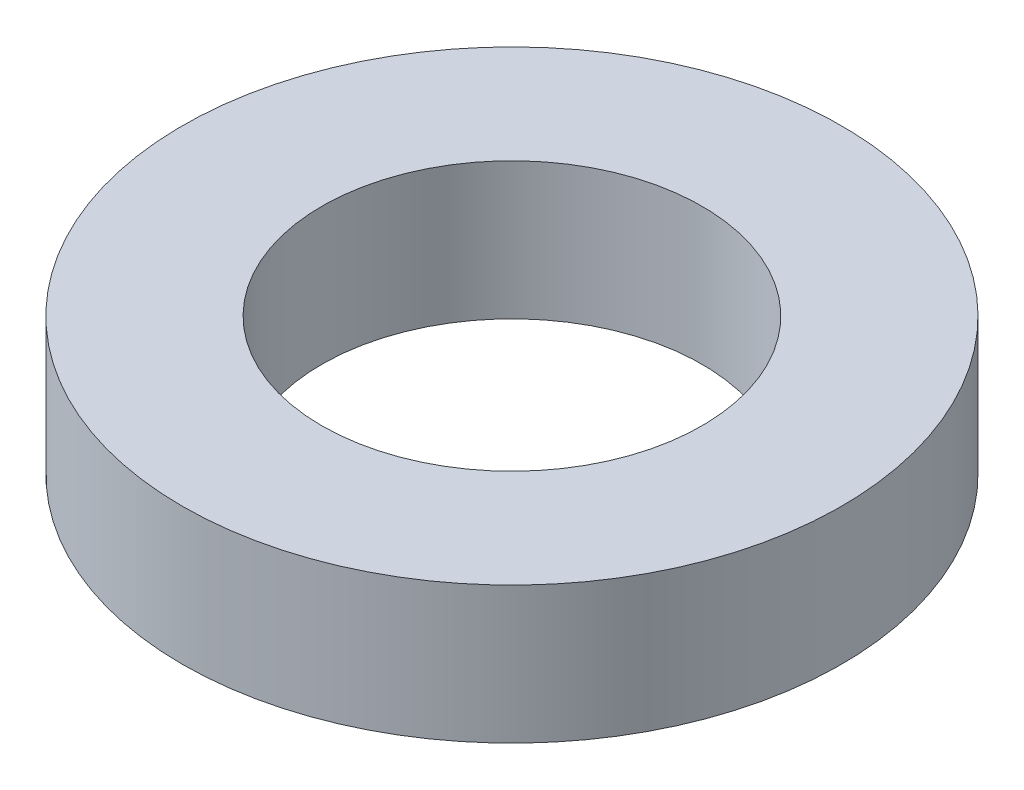
ISO-10303-21;
HEADER;
FILE_DESCRIPTION(('STEP AP214'),'2;1');
FILE_NAME('part.step','',(''),(''),'','','');
FILE_SCHEMA(('AUTOMOTIVE_DESIGN { 1 0 10303 214 1 1 1 1 }'));
ENDSEC;
DATA;
#1=APPLICATION_CONTEXT('core data for automotive mechanical design processes');
#2=APPLICATION_PROTOCOL_DEFINITION('international standard','automotive_design',2000,#1);
#3=PRODUCT_CONTEXT('',#1,'mechanical');
#4=PRODUCT('Part','Part','',(#3));
#5=PRODUCT_RELATED_PRODUCT_CATEGORY('part','',(#4));
#6=PRODUCT_DEFINITION_FORMATION('','',#4);
#7=PRODUCT_DEFINITION_CONTEXT('part definition',#1,'design');
#8=PRODUCT_DEFINITION('design','',#6,#7);
#9=PRODUCT_DEFINITION_SHAPE('','',#8);
#10=(LENGTH_UNIT() NAMED_UNIT(*) SI_UNIT(.MILLI.,.METRE.));
#11=(NAMED_UNIT(*) PLANE_ANGLE_UNIT() SI_UNIT($,.RADIAN.));
#12=(NAMED_UNIT(*) SI_UNIT($,.STERADIAN.) SOLID_ANGLE_UNIT());
#13=UNCERTAINTY_MEASURE_WITH_UNIT(LENGTH_MEASURE(1.E-05),#10,'distance_accuracy_value','');
#14=(GEOMETRIC_REPRESENTATION_CONTEXT(3) GLOBAL_UNCERTAINTY_ASSIGNED_CONTEXT((#13)) GLOBAL_UNIT_ASSIGNED_CONTEXT((#10,
#11,#12)) REPRESENTATION_CONTEXT('',''));
#15=CARTESIAN_POINT('',(0.,0.,0.));
#16=DIRECTION('',(0.,0.,1.));
#17=DIRECTION('',(1.,0.,0.));
#18=AXIS2_PLACEMENT_3D('',#15,#16,#17);
#19=CARTESIAN_POINT('',(0.,27.,0.));
#20=DIRECTION('',(0.,-1.,0.));
#21=DIRECTION('',(0.,0.,-1.));
#22=AXIS2_PLACEMENT_3D('',#19,#20,#21);
#23=CYLINDRICAL_SURFACE('',#22,65.);
#24=CARTESIAN_POINT('',(0.,27.,0.));
#25=DIRECTION('',(0.,1.,0.));
#26=DIRECTION('',(0.,0.,1.));
#27=AXIS2_PLACEMENT_3D('',#24,#25,#26);
#28=CIRCLE('',#27,65.);
#29=CARTESIAN_POINT('',(0.,27.,65.));
#30=VERTEX_POINT('',#29);
#31=EDGE_CURVE('E10',#30,#30,#28,.T.);
#32=ORIENTED_EDGE('',*,*,#31,.F.);
#33=EDGE_LOOP('',(#32));
#34=FACE_BOUND('',#33,.T.);
#35=CARTESIAN_POINT('',(0.,0.,0.));
#36=DIRECTION('',(0.,1.,0.));
#37=DIRECTION('',(0.,0.,1.));
#38=AXIS2_PLACEMENT_3D('',#35,#36,#37);
#39=CIRCLE('',#38,65.);
#40=CARTESIAN_POINT('',(0.,0.,65.));
#41=VERTEX_POINT('',#40);
#42=EDGE_CURVE('E37',#41,#41,#39,.T.);
#43=ORIENTED_EDGE('',*,*,#42,.T.);
#44=EDGE_LOOP('',(#43));
#45=FACE_BOUND('',#44,.T.);
#46=ADVANCED_FACE('F40',(#34,#45),#23,.T.);
#47=CARTESIAN_POINT('',(0.,27.,0.));
#48=DIRECTION('',(0.,1.,0.));
#49=DIRECTION('',(0.,0.,1.));
#50=AXIS2_PLACEMENT_3D('',#47,#48,#49);
#51=PLANE('',#50);
#52=CARTESIAN_POINT('',(0.,27.,0.));
#53=DIRECTION('',(0.,1.,0.));
#54=DIRECTION('',(0.,0.,1.));
#55=AXIS2_PLACEMENT_3D('',#52,#53,#54);
#56=CIRCLE('',#55,37.5);
#57=CARTESIAN_POINT('',(0.,27.,37.5));
#58=VERTEX_POINT('',#57);
#59=EDGE_CURVE('E50',#58,#58,#56,.T.);
#60=ORIENTED_EDGE('',*,*,#59,.F.);
#61=EDGE_LOOP('',(#60));
#62=FACE_BOUND('',#61,.T.);
#63=ORIENTED_EDGE('',*,*,#31,.T.);
#64=EDGE_LOOP('',(#63));
#65=FACE_BOUND('',#64,.T.);
#66=ADVANCED_FACE('F59',(#62,#65),#51,.T.);
#67=CARTESIAN_POINT('',(0.,0.,0.));
#68=DIRECTION('',(0.,1.,0.));
#69=DIRECTION('',(0.,0.,1.));
#70=AXIS2_PLACEMENT_3D('',#67,#68,#69);
#71=PLANE('',#70);
#72=CARTESIAN_POINT('',(0.,0.,0.));
#73=DIRECTION('',(0.,1.,0.));
#74=DIRECTION('',(0.,0.,1.));
#75=AXIS2_PLACEMENT_3D('',#72,#73,#74);
#76=CIRCLE('',#75,37.5);
#77=CARTESIAN_POINT('',(0.,0.,37.5));
#78=VERTEX_POINT('',#77);
#79=EDGE_CURVE('E47',#78,#78,#76,.T.);
#80=ORIENTED_EDGE('',*,*,#79,.T.);
#81=EDGE_LOOP('',(#80));
#82=FACE_BOUND('',#81,.T.);
#83=ORIENTED_EDGE('',*,*,#42,.F.);
#84=EDGE_LOOP('',(#83));
#85=FACE_BOUND('',#84,.T.);
#86=ADVANCED_FACE('F58',(#82,#85),#71,.F.);
#87=CARTESIAN_POINT('',(0.,27.,0.));
#88=DIRECTION('',(0.,-1.,0.));
#89=DIRECTION('',(0.,0.,-1.));
#90=AXIS2_PLACEMENT_3D('',#87,#88,#89);
#91=CYLINDRICAL_SURFACE('',#90,37.5);
#92=ORIENTED_EDGE('',*,*,#59,.T.);
#93=EDGE_LOOP('',(#92));
#94=FACE_BOUND('',#93,.T.);
#95=ORIENTED_EDGE('',*,*,#79,.F.);
#96=EDGE_LOOP('',(#95));
#97=FACE_BOUND('',#96,.T.);
#98=ADVANCED_FACE('F54',(#94,#97),#91,.F.);
#99=CLOSED_SHELL('',(#46,#66,#86,#98));
#100=MANIFOLD_SOLID_BREP('B2',#99);
#101=ADVANCED_BREP_SHAPE_REPRESENTATION('',(#18,#100),#14);
#102=SHAPE_DEFINITION_REPRESENTATION(#9,#101);
ENDSEC;
END-ISO-10303-21;
